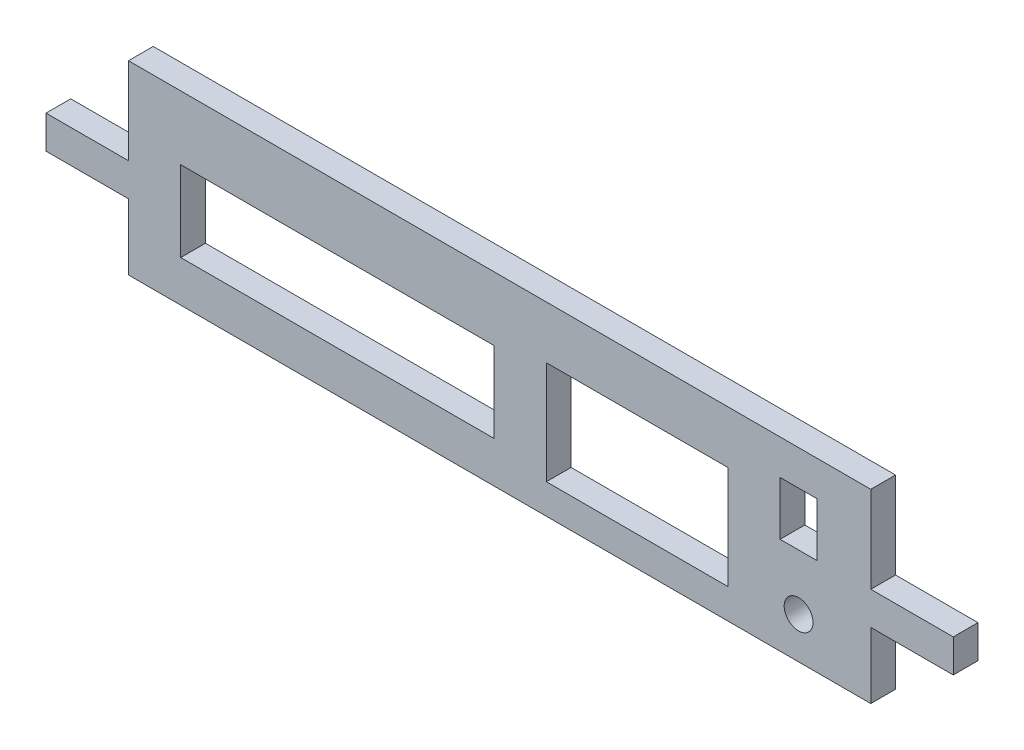
ISO-10303-21;
HEADER;
FILE_DESCRIPTION(('STEP AP214'),'2;1');
FILE_NAME('part.step','',(''),(''),'','','');
FILE_SCHEMA(('AUTOMOTIVE_DESIGN { 1 0 10303 214 1 1 1 1 }'));
ENDSEC;
DATA;
#1=APPLICATION_CONTEXT('core data for automotive mechanical design processes');
#2=APPLICATION_PROTOCOL_DEFINITION('international standard','automotive_design',2000,#1);
#3=PRODUCT_CONTEXT('',#1,'mechanical');
#4=PRODUCT('Part','Part','',(#3));
#5=PRODUCT_RELATED_PRODUCT_CATEGORY('part','',(#4));
#6=PRODUCT_DEFINITION_FORMATION('','',#4);
#7=PRODUCT_DEFINITION_CONTEXT('part definition',#1,'design');
#8=PRODUCT_DEFINITION('design','',#6,#7);
#9=PRODUCT_DEFINITION_SHAPE('','',#8);
#10=(LENGTH_UNIT() NAMED_UNIT(*) SI_UNIT(.MILLI.,.METRE.));
#11=(NAMED_UNIT(*) PLANE_ANGLE_UNIT() SI_UNIT($,.RADIAN.));
#12=(NAMED_UNIT(*) SI_UNIT($,.STERADIAN.) SOLID_ANGLE_UNIT());
#13=UNCERTAINTY_MEASURE_WITH_UNIT(LENGTH_MEASURE(1.E-05),#10,'distance_accuracy_value','');
#14=(GEOMETRIC_REPRESENTATION_CONTEXT(3) GLOBAL_UNCERTAINTY_ASSIGNED_CONTEXT((#13)) GLOBAL_UNIT_ASSIGNED_CONTEXT((#10,
#11,#12)) REPRESENTATION_CONTEXT('',''));
#15=CARTESIAN_POINT('',(0.,0.,0.));
#16=DIRECTION('',(0.,0.,1.));
#17=DIRECTION('',(1.,0.,0.));
#18=AXIS2_PLACEMENT_3D('',#15,#16,#17);
#19=CARTESIAN_POINT('',(0.,14.,6.));
#20=DIRECTION('',(0.,1.,0.));
#21=DIRECTION('',(0.,0.,1.));
#22=AXIS2_PLACEMENT_3D('',#19,#20,#21);
#23=PLANE('',#22);
#24=DIRECTION('',(1.,0.,0.));
#25=VECTOR('',#24,1.);
#26=CARTESIAN_POINT('',(0.,14.,0.));
#27=LINE('',#26,#25);
#28=CARTESIAN_POINT('',(67.9999999999999,14.,0.));
#29=VERTEX_POINT('',#28);
#30=CARTESIAN_POINT('',(76.9999999999999,14.,0.));
#31=VERTEX_POINT('',#30);
#32=EDGE_CURVE('E290',#29,#31,#27,.T.);
#33=ORIENTED_EDGE('',*,*,#32,.T.);
#34=DIRECTION('',(0.,0.,-1.));
#35=VECTOR('',#34,1.);
#36=CARTESIAN_POINT('',(76.9999999999999,14.,6.));
#37=LINE('',#36,#35);
#38=CARTESIAN_POINT('',(76.9999999999999,14.,6.));
#39=VERTEX_POINT('',#38);
#40=EDGE_CURVE('E11',#39,#31,#37,.T.);
#41=ORIENTED_EDGE('',*,*,#40,.F.);
#42=DIRECTION('',(1.,0.,0.));
#43=VECTOR('',#42,1.);
#44=CARTESIAN_POINT('',(0.,14.,6.));
#45=LINE('',#44,#43);
#46=CARTESIAN_POINT('',(67.9999999999999,14.,6.));
#47=VERTEX_POINT('',#46);
#48=EDGE_CURVE('E210',#47,#39,#45,.T.);
#49=ORIENTED_EDGE('',*,*,#48,.F.);
#50=DIRECTION('',(0.,0.,-1.));
#51=VECTOR('',#50,1.);
#52=CARTESIAN_POINT('',(67.9999999999999,14.,6.));
#53=LINE('',#52,#51);
#54=EDGE_CURVE('E54',#47,#29,#53,.T.);
#55=ORIENTED_EDGE('',*,*,#54,.T.);
#56=EDGE_LOOP('',(#33,#41,#49,#55));
#57=FACE_BOUND('',#56,.T.);
#58=ADVANCED_FACE('F35',(#57),#23,.F.);
#59=CARTESIAN_POINT('',(76.9999999999999,0.,6.));
#60=DIRECTION('',(1.,0.,0.));
#61=DIRECTION('',(0.,0.,-1.));
#62=AXIS2_PLACEMENT_3D('',#59,#60,#61);
#63=PLANE('',#62);
#64=DIRECTION('',(0.,-1.,0.));
#65=VECTOR('',#64,1.);
#66=CARTESIAN_POINT('',(76.9999999999999,0.,0.));
#67=LINE('',#66,#65);
#68=CARTESIAN_POINT('',(76.9999999999999,0.999999999999973,0.));
#69=VERTEX_POINT('',#68);
#70=EDGE_CURVE('E216',#31,#69,#67,.T.);
#71=ORIENTED_EDGE('',*,*,#70,.T.);
#72=DIRECTION('',(0.,0.,-1.));
#73=VECTOR('',#72,1.);
#74=CARTESIAN_POINT('',(76.9999999999999,0.999999999999973,6.));
#75=LINE('',#74,#73);
#76=CARTESIAN_POINT('',(76.9999999999999,0.999999999999973,6.));
#77=VERTEX_POINT('',#76);
#78=EDGE_CURVE('E45',#77,#69,#75,.T.);
#79=ORIENTED_EDGE('',*,*,#78,.F.);
#80=DIRECTION('',(0.,-1.,0.));
#81=VECTOR('',#80,1.);
#82=CARTESIAN_POINT('',(76.9999999999999,0.,6.));
#83=LINE('',#82,#81);
#84=EDGE_CURVE('E204',#39,#77,#83,.T.);
#85=ORIENTED_EDGE('',*,*,#84,.F.);
#86=ORIENTED_EDGE('',*,*,#40,.T.);
#87=EDGE_LOOP('',(#71,#79,#85,#86));
#88=FACE_BOUND('',#87,.T.);
#89=ADVANCED_FACE('F215',(#88),#63,.F.);
#90=CARTESIAN_POINT('',(0.,0.999999999999973,6.));
#91=DIRECTION('',(0.,1.,0.));
#92=DIRECTION('',(0.,0.,1.));
#93=AXIS2_PLACEMENT_3D('',#90,#91,#92);
#94=PLANE('',#93);
#95=DIRECTION('',(1.,0.,0.));
#96=VECTOR('',#95,1.);
#97=CARTESIAN_POINT('',(0.,0.999999999999973,0.));
#98=LINE('',#97,#96);
#99=CARTESIAN_POINT('',(67.9999999999999,0.999999999999973,0.));
#100=VERTEX_POINT('',#99);
#101=EDGE_CURVE('E293',#100,#69,#98,.T.);
#102=ORIENTED_EDGE('',*,*,#101,.F.);
#103=DIRECTION('',(0.,0.,-1.));
#104=VECTOR('',#103,1.);
#105=CARTESIAN_POINT('',(67.9999999999999,0.999999999999973,6.));
#106=LINE('',#105,#104);
#107=CARTESIAN_POINT('',(67.9999999999999,0.999999999999973,6.));
#108=VERTEX_POINT('',#107);
#109=EDGE_CURVE('E128',#108,#100,#106,.T.);
#110=ORIENTED_EDGE('',*,*,#109,.F.);
#111=DIRECTION('',(1.,0.,0.));
#112=VECTOR('',#111,1.);
#113=CARTESIAN_POINT('',(0.,0.999999999999973,6.));
#114=LINE('',#113,#112);
#115=EDGE_CURVE('E209',#108,#77,#114,.T.);
#116=ORIENTED_EDGE('',*,*,#115,.T.);
#117=ORIENTED_EDGE('',*,*,#78,.T.);
#118=EDGE_LOOP('',(#102,#110,#116,#117));
#119=FACE_BOUND('',#118,.T.);
#120=ADVANCED_FACE('F220',(#119),#94,.T.);
#121=CARTESIAN_POINT('',(0.,9.74999999999996,6.));
#122=DIRECTION('',(0.,1.,0.));
#123=DIRECTION('',(0.,0.,1.));
#124=AXIS2_PLACEMENT_3D('',#121,#122,#123);
#125=PLANE('',#124);
#126=DIRECTION('',(1.,0.,0.));
#127=VECTOR('',#126,1.);
#128=CARTESIAN_POINT('',(0.,9.74999999999996,0.));
#129=LINE('',#128,#127);
#130=CARTESIAN_POINT('',(11.3333333333333,9.74999999999996,0.));
#131=VERTEX_POINT('',#130);
#132=CARTESIAN_POINT('',(55.3333333333333,9.74999999999996,0.));
#133=VERTEX_POINT('',#132);
#134=EDGE_CURVE('E278',#131,#133,#129,.T.);
#135=ORIENTED_EDGE('',*,*,#134,.T.);
#136=DIRECTION('',(0.,0.,-1.));
#137=VECTOR('',#136,1.);
#138=CARTESIAN_POINT('',(55.3333333333333,9.74999999999996,6.));
#139=LINE('',#138,#137);
#140=CARTESIAN_POINT('',(55.3333333333333,9.74999999999996,6.));
#141=VERTEX_POINT('',#140);
#142=EDGE_CURVE('E300',#141,#133,#139,.T.);
#143=ORIENTED_EDGE('',*,*,#142,.F.);
#144=DIRECTION('',(1.,0.,0.));
#145=VECTOR('',#144,1.);
#146=CARTESIAN_POINT('',(0.,9.74999999999996,6.));
#147=LINE('',#146,#145);
#148=CARTESIAN_POINT('',(11.3333333333333,9.74999999999996,6.));
#149=VERTEX_POINT('',#148);
#150=EDGE_CURVE('E403',#149,#141,#147,.T.);
#151=ORIENTED_EDGE('',*,*,#150,.F.);
#152=DIRECTION('',(0.,0.,-1.));
#153=VECTOR('',#152,1.);
#154=CARTESIAN_POINT('',(11.3333333333333,9.74999999999996,6.));
#155=LINE('',#154,#153);
#156=EDGE_CURVE('E302',#149,#131,#155,.T.);
#157=ORIENTED_EDGE('',*,*,#156,.T.);
#158=EDGE_LOOP('',(#135,#143,#151,#157));
#159=FACE_BOUND('',#158,.T.);
#160=ADVANCED_FACE('F429',(#159),#125,.F.);
#161=CARTESIAN_POINT('',(55.3333333333333,0.,6.));
#162=DIRECTION('',(1.,0.,0.));
#163=DIRECTION('',(0.,1.,0.));
#164=AXIS2_PLACEMENT_3D('',#161,#162,#163);
#165=PLANE('',#164);
#166=DIRECTION('',(0.,-1.,0.));
#167=VECTOR('',#166,1.);
#168=CARTESIAN_POINT('',(55.3333333333333,0.,0.));
#169=LINE('',#168,#167);
#170=CARTESIAN_POINT('',(55.3333333333333,-15.25,0.));
#171=VERTEX_POINT('',#170);
#172=EDGE_CURVE('E281',#133,#171,#169,.T.);
#173=ORIENTED_EDGE('',*,*,#172,.T.);
#174=DIRECTION('',(0.,0.,-1.));
#175=VECTOR('',#174,1.);
#176=CARTESIAN_POINT('',(55.3333333333333,-15.25,6.));
#177=LINE('',#176,#175);
#178=CARTESIAN_POINT('',(55.3333333333333,-15.25,6.));
#179=VERTEX_POINT('',#178);
#180=EDGE_CURVE('E307',#179,#171,#177,.T.);
#181=ORIENTED_EDGE('',*,*,#180,.F.);
#182=DIRECTION('',(0.,-1.,0.));
#183=VECTOR('',#182,1.);
#184=CARTESIAN_POINT('',(55.3333333333333,0.,6.));
#185=LINE('',#184,#183);
#186=EDGE_CURVE('E406',#141,#179,#185,.T.);
#187=ORIENTED_EDGE('',*,*,#186,.F.);
#188=ORIENTED_EDGE('',*,*,#142,.T.);
#189=EDGE_LOOP('',(#173,#181,#187,#188));
#190=FACE_BOUND('',#189,.T.);
#191=ADVANCED_FACE('F431',(#190),#165,.F.);
#192=CARTESIAN_POINT('',(0.,-15.25,6.));
#193=DIRECTION('',(0.,1.,0.));
#194=DIRECTION('',(0.,0.,1.));
#195=AXIS2_PLACEMENT_3D('',#192,#193,#194);
#196=PLANE('',#195);
#197=DIRECTION('',(1.,0.,0.));
#198=VECTOR('',#197,1.);
#199=CARTESIAN_POINT('',(0.,-15.25,0.));
#200=LINE('',#199,#198);
#201=CARTESIAN_POINT('',(11.3333333333333,-15.25,0.));
#202=VERTEX_POINT('',#201);
#203=EDGE_CURVE('E284',#202,#171,#200,.T.);
#204=ORIENTED_EDGE('',*,*,#203,.F.);
#205=DIRECTION('',(0.,0.,-1.));
#206=VECTOR('',#205,1.);
#207=CARTESIAN_POINT('',(11.3333333333333,-15.25,6.));
#208=LINE('',#207,#206);
#209=CARTESIAN_POINT('',(11.3333333333333,-15.25,6.));
#210=VERTEX_POINT('',#209);
#211=EDGE_CURVE('E304',#210,#202,#208,.T.);
#212=ORIENTED_EDGE('',*,*,#211,.F.);
#213=DIRECTION('',(1.,0.,0.));
#214=VECTOR('',#213,1.);
#215=CARTESIAN_POINT('',(0.,-15.25,6.));
#216=LINE('',#215,#214);
#217=EDGE_CURVE('E408',#210,#179,#216,.T.);
#218=ORIENTED_EDGE('',*,*,#217,.T.);
#219=ORIENTED_EDGE('',*,*,#180,.T.);
#220=EDGE_LOOP('',(#204,#212,#218,#219));
#221=FACE_BOUND('',#220,.T.);
#222=ADVANCED_FACE('F424',(#221),#196,.T.);
#223=CARTESIAN_POINT('',(0.,22.5,6.));
#224=DIRECTION('',(0.,1.,0.));
#225=DIRECTION('',(0.,0.,1.));
#226=AXIS2_PLACEMENT_3D('',#223,#224,#225);
#227=PLANE('',#226);
#228=DIRECTION('',(1.,0.,0.));
#229=VECTOR('',#228,1.);
#230=CARTESIAN_POINT('',(0.,22.5,0.));
#231=LINE('',#230,#229);
#232=CARTESIAN_POINT('',(-90.,22.5,0.));
#233=VERTEX_POINT('',#232);
#234=CARTESIAN_POINT('',(90.,22.5,0.));
#235=VERTEX_POINT('',#234);
#236=EDGE_CURVE('E242',#233,#235,#231,.T.);
#237=ORIENTED_EDGE('',*,*,#236,.F.);
#238=DIRECTION('',(0.,0.,-1.));
#239=VECTOR('',#238,1.);
#240=CARTESIAN_POINT('',(-90.,22.5,6.));
#241=LINE('',#240,#239);
#242=CARTESIAN_POINT('',(-90.,22.5,6.));
#243=VERTEX_POINT('',#242);
#244=EDGE_CURVE('E305',#243,#233,#241,.T.);
#245=ORIENTED_EDGE('',*,*,#244,.F.);
#246=DIRECTION('',(1.,0.,0.));
#247=VECTOR('',#246,1.);
#248=CARTESIAN_POINT('',(0.,22.5,6.));
#249=LINE('',#248,#247);
#250=CARTESIAN_POINT('',(90.,22.5,6.));
#251=VERTEX_POINT('',#250);
#252=EDGE_CURVE('E363',#243,#251,#249,.T.);
#253=ORIENTED_EDGE('',*,*,#252,.T.);
#254=DIRECTION('',(0.,0.,-1.));
#255=VECTOR('',#254,1.);
#256=CARTESIAN_POINT('',(90.,22.5,6.));
#257=LINE('',#256,#255);
#258=EDGE_CURVE('E311',#251,#235,#257,.T.);
#259=ORIENTED_EDGE('',*,*,#258,.T.);
#260=EDGE_LOOP('',(#237,#245,#253,#259));
#261=FACE_BOUND('',#260,.T.);
#262=ADVANCED_FACE('F438',(#261),#227,.T.);
#263=CARTESIAN_POINT('',(-90.,0.,6.));
#264=DIRECTION('',(1.,0.,0.));
#265=DIRECTION('',(0.,1.,0.));
#266=AXIS2_PLACEMENT_3D('',#263,#264,#265);
#267=PLANE('',#266);
#268=DIRECTION('',(0.,-1.,0.));
#269=VECTOR('',#268,1.);
#270=CARTESIAN_POINT('',(-90.,0.,0.));
#271=LINE('',#270,#269);
#272=CARTESIAN_POINT('',(-90.,1.49999999999997,0.));
#273=VERTEX_POINT('',#272);
#274=EDGE_CURVE('E245',#233,#273,#271,.T.);
#275=ORIENTED_EDGE('',*,*,#274,.T.);
#276=DIRECTION('',(0.,0.,-1.));
#277=VECTOR('',#276,1.);
#278=CARTESIAN_POINT('',(-90.,1.49999999999997,6.));
#279=LINE('',#278,#277);
#280=CARTESIAN_POINT('',(-90.,1.49999999999997,6.));
#281=VERTEX_POINT('',#280);
#282=EDGE_CURVE('E333',#281,#273,#279,.T.);
#283=ORIENTED_EDGE('',*,*,#282,.F.);
#284=DIRECTION('',(0.,-1.,0.));
#285=VECTOR('',#284,1.);
#286=CARTESIAN_POINT('',(-90.,0.,6.));
#287=LINE('',#286,#285);
#288=EDGE_CURVE('E373',#243,#281,#287,.T.);
#289=ORIENTED_EDGE('',*,*,#288,.F.);
#290=ORIENTED_EDGE('',*,*,#244,.T.);
#291=EDGE_LOOP('',(#275,#283,#289,#290));
#292=FACE_BOUND('',#291,.T.);
#293=ADVANCED_FACE('F506',(#292),#267,.F.);
#294=CARTESIAN_POINT('',(0.,1.49999999999998,6.));
#295=DIRECTION('',(0.,-1.,0.));
#296=DIRECTION('',(1.,0.,0.));
#297=AXIS2_PLACEMENT_3D('',#294,#295,#296);
#298=PLANE('',#297);
#299=DIRECTION('',(-1.,0.,0.));
#300=VECTOR('',#299,1.);
#301=CARTESIAN_POINT('',(0.,1.49999999999998,0.));
#302=LINE('',#301,#300);
#303=CARTESIAN_POINT('',(-110.,1.49999999999996,0.));
#304=VERTEX_POINT('',#303);
#305=EDGE_CURVE('E248',#273,#304,#302,.T.);
#306=ORIENTED_EDGE('',*,*,#305,.T.);
#307=DIRECTION('',(0.,0.,-1.));
#308=VECTOR('',#307,1.);
#309=CARTESIAN_POINT('',(-110.,1.49999999999996,6.));
#310=LINE('',#309,#308);
#311=CARTESIAN_POINT('',(-110.,1.49999999999996,6.));
#312=VERTEX_POINT('',#311);
#313=EDGE_CURVE('E331',#312,#304,#310,.T.);
#314=ORIENTED_EDGE('',*,*,#313,.F.);
#315=DIRECTION('',(-1.,0.,0.));
#316=VECTOR('',#315,1.);
#317=CARTESIAN_POINT('',(0.,1.49999999999998,6.));
#318=LINE('',#317,#316);
#319=EDGE_CURVE('E376',#281,#312,#318,.T.);
#320=ORIENTED_EDGE('',*,*,#319,.F.);
#321=ORIENTED_EDGE('',*,*,#282,.T.);
#322=EDGE_LOOP('',(#306,#314,#320,#321));
#323=FACE_BOUND('',#322,.T.);
#324=ADVANCED_FACE('F502',(#323),#298,.F.);
#325=CARTESIAN_POINT('',(-110.,0.,6.));
#326=DIRECTION('',(-1.,0.,0.));
#327=DIRECTION('',(0.,0.,1.));
#328=AXIS2_PLACEMENT_3D('',#325,#326,#327);
#329=PLANE('',#328);
#330=DIRECTION('',(0.,1.,0.));
#331=VECTOR('',#330,1.);
#332=CARTESIAN_POINT('',(-110.,0.,0.));
#333=LINE('',#332,#331);
#334=CARTESIAN_POINT('',(-110.,-6.50000000000004,0.));
#335=VERTEX_POINT('',#334);
#336=EDGE_CURVE('E251',#335,#304,#333,.T.);
#337=ORIENTED_EDGE('',*,*,#336,.F.);
#338=DIRECTION('',(0.,0.,-1.));
#339=VECTOR('',#338,1.);
#340=CARTESIAN_POINT('',(-110.,-6.50000000000004,6.));
#341=LINE('',#340,#339);
#342=CARTESIAN_POINT('',(-110.,-6.50000000000004,6.));
#343=VERTEX_POINT('',#342);
#344=EDGE_CURVE('E329',#343,#335,#341,.T.);
#345=ORIENTED_EDGE('',*,*,#344,.F.);
#346=DIRECTION('',(0.,1.,0.));
#347=VECTOR('',#346,1.);
#348=CARTESIAN_POINT('',(-110.,0.,6.));
#349=LINE('',#348,#347);
#350=EDGE_CURVE('E378',#343,#312,#349,.T.);
#351=ORIENTED_EDGE('',*,*,#350,.T.);
#352=ORIENTED_EDGE('',*,*,#313,.T.);
#353=EDGE_LOOP('',(#337,#345,#351,#352));
#354=FACE_BOUND('',#353,.T.);
#355=ADVANCED_FACE('F498',(#354),#329,.T.);
#356=CARTESIAN_POINT('',(0.,-6.50000000000003,6.));
#357=DIRECTION('',(0.,-1.,0.));
#358=DIRECTION('',(1.,0.,0.));
#359=AXIS2_PLACEMENT_3D('',#356,#357,#358);
#360=PLANE('',#359);
#361=DIRECTION('',(-1.,0.,0.));
#362=VECTOR('',#361,1.);
#363=CARTESIAN_POINT('',(0.,-6.50000000000003,0.));
#364=LINE('',#363,#362);
#365=CARTESIAN_POINT('',(-90.,-6.50000000000003,0.));
#366=VERTEX_POINT('',#365);
#367=EDGE_CURVE('E254',#366,#335,#364,.T.);
#368=ORIENTED_EDGE('',*,*,#367,.F.);
#369=DIRECTION('',(0.,0.,-1.));
#370=VECTOR('',#369,1.);
#371=CARTESIAN_POINT('',(-90.,-6.50000000000003,6.));
#372=LINE('',#371,#370);
#373=CARTESIAN_POINT('',(-90.,-6.50000000000003,6.));
#374=VERTEX_POINT('',#373);
#375=EDGE_CURVE('E327',#374,#366,#372,.T.);
#376=ORIENTED_EDGE('',*,*,#375,.F.);
#377=DIRECTION('',(-1.,0.,0.));
#378=VECTOR('',#377,1.);
#379=CARTESIAN_POINT('',(0.,-6.50000000000003,6.));
#380=LINE('',#379,#378);
#381=EDGE_CURVE('E381',#374,#343,#380,.T.);
#382=ORIENTED_EDGE('',*,*,#381,.T.);
#383=ORIENTED_EDGE('',*,*,#344,.T.);
#384=EDGE_LOOP('',(#368,#376,#382,#383));
#385=FACE_BOUND('',#384,.T.);
#386=ADVANCED_FACE('F494',(#385),#360,.T.);
#387=CARTESIAN_POINT('',(-90.,1.56125112837913E-13,6.));
#388=DIRECTION('',(1.,0.,0.));
#389=DIRECTION('',(0.,1.,0.));
#390=AXIS2_PLACEMENT_3D('',#387,#388,#389);
#391=PLANE('',#390);
#392=DIRECTION('',(0.,-1.,0.));
#393=VECTOR('',#392,1.);
#394=CARTESIAN_POINT('',(-90.,1.56125112837913E-13,0.));
#395=LINE('',#394,#393);
#396=CARTESIAN_POINT('',(-90.,-22.5,0.));
#397=VERTEX_POINT('',#396);
#398=EDGE_CURVE('E257',#366,#397,#395,.T.);
#399=ORIENTED_EDGE('',*,*,#398,.T.);
#400=DIRECTION('',(0.,0.,-1.));
#401=VECTOR('',#400,1.);
#402=CARTESIAN_POINT('',(-90.,-22.5,6.));
#403=LINE('',#402,#401);
#404=CARTESIAN_POINT('',(-90.,-22.5,6.));
#405=VERTEX_POINT('',#404);
#406=EDGE_CURVE('E324',#405,#397,#403,.T.);
#407=ORIENTED_EDGE('',*,*,#406,.F.);
#408=DIRECTION('',(0.,-1.,0.));
#409=VECTOR('',#408,1.);
#410=CARTESIAN_POINT('',(-90.,1.56125112837913E-13,6.));
#411=LINE('',#410,#409);
#412=EDGE_CURVE('E384',#374,#405,#411,.T.);
#413=ORIENTED_EDGE('',*,*,#412,.F.);
#414=ORIENTED_EDGE('',*,*,#375,.T.);
#415=EDGE_LOOP('',(#399,#407,#413,#414));
#416=FACE_BOUND('',#415,.T.);
#417=ADVANCED_FACE('F490',(#416),#391,.F.);
#418=CARTESIAN_POINT('',(0.,-22.5,6.));
#419=DIRECTION('',(0.,1.,0.));
#420=DIRECTION('',(0.,0.,1.));
#421=AXIS2_PLACEMENT_3D('',#418,#419,#420);
#422=PLANE('',#421);
#423=DIRECTION('',(1.,0.,0.));
#424=VECTOR('',#423,1.);
#425=CARTESIAN_POINT('',(0.,-22.5,0.));
#426=LINE('',#425,#424);
#427=CARTESIAN_POINT('',(89.9999999999999,-22.5,0.));
#428=VERTEX_POINT('',#427);
#429=EDGE_CURVE('E260',#397,#428,#426,.T.);
#430=ORIENTED_EDGE('',*,*,#429,.T.);
#431=DIRECTION('',(0.,0.,-1.));
#432=VECTOR('',#431,1.);
#433=CARTESIAN_POINT('',(89.9999999999999,-22.5,6.));
#434=LINE('',#433,#432);
#435=CARTESIAN_POINT('',(89.9999999999999,-22.5,6.));
#436=VERTEX_POINT('',#435);
#437=EDGE_CURVE('E322',#436,#428,#434,.T.);
#438=ORIENTED_EDGE('',*,*,#437,.F.);
#439=DIRECTION('',(1.,0.,0.));
#440=VECTOR('',#439,1.);
#441=CARTESIAN_POINT('',(0.,-22.5,6.));
#442=LINE('',#441,#440);
#443=EDGE_CURVE('E387',#405,#436,#442,.T.);
#444=ORIENTED_EDGE('',*,*,#443,.F.);
#445=ORIENTED_EDGE('',*,*,#406,.T.);
#446=EDGE_LOOP('',(#430,#438,#444,#445));
#447=FACE_BOUND('',#446,.T.);
#448=ADVANCED_FACE('F486',(#447),#422,.F.);
#449=CARTESIAN_POINT('',(89.9999999999999,1.56125112837913E-13,6.));
#450=DIRECTION('',(1.,0.,0.));
#451=DIRECTION('',(0.,1.,0.));
#452=AXIS2_PLACEMENT_3D('',#449,#450,#451);
#453=PLANE('',#452);
#454=DIRECTION('',(0.,-1.,0.));
#455=VECTOR('',#454,1.);
#456=CARTESIAN_POINT('',(89.9999999999999,1.56125112837913E-13,0.));
#457=LINE('',#456,#455);
#458=CARTESIAN_POINT('',(89.9999999999999,-6.50000000000003,0.));
#459=VERTEX_POINT('',#458);
#460=EDGE_CURVE('E263',#459,#428,#457,.T.);
#461=ORIENTED_EDGE('',*,*,#460,.F.);
#462=DIRECTION('',(0.,0.,-1.));
#463=VECTOR('',#462,1.);
#464=CARTESIAN_POINT('',(89.9999999999999,-6.50000000000003,6.));
#465=LINE('',#464,#463);
#466=CARTESIAN_POINT('',(89.9999999999999,-6.50000000000003,6.));
#467=VERTEX_POINT('',#466);
#468=EDGE_CURVE('E320',#467,#459,#465,.T.);
#469=ORIENTED_EDGE('',*,*,#468,.F.);
#470=DIRECTION('',(0.,-1.,0.));
#471=VECTOR('',#470,1.);
#472=CARTESIAN_POINT('',(89.9999999999999,1.56125112837913E-13,6.));
#473=LINE('',#472,#471);
#474=EDGE_CURVE('E389',#467,#436,#473,.T.);
#475=ORIENTED_EDGE('',*,*,#474,.T.);
#476=ORIENTED_EDGE('',*,*,#437,.T.);
#477=EDGE_LOOP('',(#461,#469,#475,#476));
#478=FACE_BOUND('',#477,.T.);
#479=ADVANCED_FACE('F482',(#478),#453,.T.);
#480=CARTESIAN_POINT('',(0.,-6.50000000000003,6.));
#481=DIRECTION('',(0.,1.,0.));
#482=DIRECTION('',(-1.,0.,0.));
#483=AXIS2_PLACEMENT_3D('',#480,#481,#482);
#484=PLANE('',#483);
#485=DIRECTION('',(1.,0.,0.));
#486=VECTOR('',#485,1.);
#487=CARTESIAN_POINT('',(0.,-6.50000000000003,0.));
#488=LINE('',#487,#486);
#489=CARTESIAN_POINT('',(110.,-6.50000000000004,0.));
#490=VERTEX_POINT('',#489);
#491=EDGE_CURVE('E266',#459,#490,#488,.T.);
#492=ORIENTED_EDGE('',*,*,#491,.T.);
#493=DIRECTION('',(0.,0.,-1.));
#494=VECTOR('',#493,1.);
#495=CARTESIAN_POINT('',(110.,-6.50000000000004,6.));
#496=LINE('',#495,#494);
#497=CARTESIAN_POINT('',(110.,-6.50000000000004,6.));
#498=VERTEX_POINT('',#497);
#499=EDGE_CURVE('E317',#498,#490,#496,.T.);
#500=ORIENTED_EDGE('',*,*,#499,.F.);
#501=DIRECTION('',(1.,0.,0.));
#502=VECTOR('',#501,1.);
#503=CARTESIAN_POINT('',(0.,-6.50000000000003,6.));
#504=LINE('',#503,#502);
#505=EDGE_CURVE('E392',#467,#498,#504,.T.);
#506=ORIENTED_EDGE('',*,*,#505,.F.);
#507=ORIENTED_EDGE('',*,*,#468,.T.);
#508=EDGE_LOOP('',(#492,#500,#506,#507));
#509=FACE_BOUND('',#508,.T.);
#510=ADVANCED_FACE('F475',(#509),#484,.F.);
#511=CARTESIAN_POINT('',(110.,0.,6.));
#512=DIRECTION('',(-1.,0.,0.));
#513=DIRECTION('',(0.,0.,1.));
#514=AXIS2_PLACEMENT_3D('',#511,#512,#513);
#515=PLANE('',#514);
#516=DIRECTION('',(0.,1.,0.));
#517=VECTOR('',#516,1.);
#518=CARTESIAN_POINT('',(110.,0.,0.));
#519=LINE('',#518,#517);
#520=CARTESIAN_POINT('',(110.,1.49999999999996,0.));
#521=VERTEX_POINT('',#520);
#522=EDGE_CURVE('E269',#490,#521,#519,.T.);
#523=ORIENTED_EDGE('',*,*,#522,.T.);
#524=DIRECTION('',(0.,0.,-1.));
#525=VECTOR('',#524,1.);
#526=CARTESIAN_POINT('',(110.,1.49999999999996,6.));
#527=LINE('',#526,#525);
#528=CARTESIAN_POINT('',(110.,1.49999999999996,6.));
#529=VERTEX_POINT('',#528);
#530=EDGE_CURVE('E315',#529,#521,#527,.T.);
#531=ORIENTED_EDGE('',*,*,#530,.F.);
#532=DIRECTION('',(0.,1.,0.));
#533=VECTOR('',#532,1.);
#534=CARTESIAN_POINT('',(110.,0.,6.));
#535=LINE('',#534,#533);
#536=EDGE_CURVE('E395',#498,#529,#535,.T.);
#537=ORIENTED_EDGE('',*,*,#536,.F.);
#538=ORIENTED_EDGE('',*,*,#499,.T.);
#539=EDGE_LOOP('',(#523,#531,#537,#538));
#540=FACE_BOUND('',#539,.T.);
#541=ADVANCED_FACE('F469',(#540),#515,.F.);
#542=CARTESIAN_POINT('',(0.,1.49999999999998,6.));
#543=DIRECTION('',(0.,1.,0.));
#544=DIRECTION('',(-1.,0.,0.));
#545=AXIS2_PLACEMENT_3D('',#542,#543,#544);
#546=PLANE('',#545);
#547=DIRECTION('',(1.,0.,0.));
#548=VECTOR('',#547,1.);
#549=CARTESIAN_POINT('',(0.,1.49999999999998,0.));
#550=LINE('',#549,#548);
#551=CARTESIAN_POINT('',(89.9999999999999,1.49999999999997,0.));
#552=VERTEX_POINT('',#551);
#553=EDGE_CURVE('E272',#552,#521,#550,.T.);
#554=ORIENTED_EDGE('',*,*,#553,.F.);
#555=DIRECTION('',(0.,0.,-1.));
#556=VECTOR('',#555,1.);
#557=CARTESIAN_POINT('',(89.9999999999999,1.49999999999997,6.));
#558=LINE('',#557,#556);
#559=CARTESIAN_POINT('',(89.9999999999999,1.49999999999997,6.));
#560=VERTEX_POINT('',#559);
#561=EDGE_CURVE('E313',#560,#552,#558,.T.);
#562=ORIENTED_EDGE('',*,*,#561,.F.);
#563=DIRECTION('',(1.,0.,0.));
#564=VECTOR('',#563,1.);
#565=CARTESIAN_POINT('',(0.,1.49999999999998,6.));
#566=LINE('',#565,#564);
#567=EDGE_CURVE('E397',#560,#529,#566,.T.);
#568=ORIENTED_EDGE('',*,*,#567,.T.);
#569=ORIENTED_EDGE('',*,*,#530,.T.);
#570=EDGE_LOOP('',(#554,#562,#568,#569));
#571=FACE_BOUND('',#570,.T.);
#572=ADVANCED_FACE('F465',(#571),#546,.T.);
#573=CARTESIAN_POINT('',(-1.33333333333336,0.,6.));
#574=DIRECTION('',(-1.,0.,0.));
#575=DIRECTION('',(0.,-1.,0.));
#576=AXIS2_PLACEMENT_3D('',#573,#574,#575);
#577=PLANE('',#576);
#578=DIRECTION('',(0.,1.,0.));
#579=VECTOR('',#578,1.);
#580=CARTESIAN_POINT('',(-1.33333333333336,0.,0.));
#581=LINE('',#580,#579);
#582=CARTESIAN_POINT('',(-1.33333333333335,-12.5,0.));
#583=VERTEX_POINT('',#582);
#584=CARTESIAN_POINT('',(-1.33333333333336,6.99999999999997,0.));
#585=VERTEX_POINT('',#584);
#586=EDGE_CURVE('E230',#583,#585,#581,.T.);
#587=ORIENTED_EDGE('',*,*,#586,.F.);
#588=DIRECTION('',(0.,0.,-1.));
#589=VECTOR('',#588,1.);
#590=CARTESIAN_POINT('',(-1.33333333333335,-12.5,6.));
#591=LINE('',#590,#589);
#592=CARTESIAN_POINT('',(-1.33333333333335,-12.5,6.));
#593=VERTEX_POINT('',#592);
#594=EDGE_CURVE('E39',#593,#583,#591,.T.);
#595=ORIENTED_EDGE('',*,*,#594,.F.);
#596=DIRECTION('',(0.,1.,0.));
#597=VECTOR('',#596,1.);
#598=CARTESIAN_POINT('',(-1.33333333333336,0.,6.));
#599=LINE('',#598,#597);
#600=CARTESIAN_POINT('',(-1.33333333333336,6.99999999999997,6.));
#601=VERTEX_POINT('',#600);
#602=EDGE_CURVE('E367',#593,#601,#599,.T.);
#603=ORIENTED_EDGE('',*,*,#602,.T.);
#604=DIRECTION('',(0.,0.,-1.));
#605=VECTOR('',#604,1.);
#606=CARTESIAN_POINT('',(-1.33333333333336,6.99999999999997,6.));
#607=LINE('',#606,#605);
#608=EDGE_CURVE('E223',#601,#585,#607,.T.);
#609=ORIENTED_EDGE('',*,*,#608,.T.);
#610=EDGE_LOOP('',(#587,#595,#603,#609));
#611=FACE_BOUND('',#610,.T.);
#612=ADVANCED_FACE('F350',(#611),#577,.T.);
#613=CARTESIAN_POINT('',(0.,-12.5,6.));
#614=DIRECTION('',(0.,1.,0.));
#615=DIRECTION('',(0.,0.,1.));
#616=AXIS2_PLACEMENT_3D('',#613,#614,#615);
#617=PLANE('',#616);
#618=DIRECTION('',(1.,0.,0.));
#619=VECTOR('',#618,1.);
#620=CARTESIAN_POINT('',(0.,-12.5,0.));
#621=LINE('',#620,#619);
#622=CARTESIAN_POINT('',(-77.3333333333334,-12.5,0.));
#623=VERTEX_POINT('',#622);
#624=EDGE_CURVE('E233',#623,#583,#621,.T.);
#625=ORIENTED_EDGE('',*,*,#624,.F.);
#626=DIRECTION('',(0.,0.,-1.));
#627=VECTOR('',#626,1.);
#628=CARTESIAN_POINT('',(-77.3333333333334,-12.5,6.));
#629=LINE('',#628,#627);
#630=CARTESIAN_POINT('',(-77.3333333333334,-12.5,6.));
#631=VERTEX_POINT('',#630);
#632=EDGE_CURVE('E340',#631,#623,#629,.T.);
#633=ORIENTED_EDGE('',*,*,#632,.F.);
#634=DIRECTION('',(1.,0.,0.));
#635=VECTOR('',#634,1.);
#636=CARTESIAN_POINT('',(0.,-12.5,6.));
#637=LINE('',#636,#635);
#638=EDGE_CURVE('E349',#631,#593,#637,.T.);
#639=ORIENTED_EDGE('',*,*,#638,.T.);
#640=ORIENTED_EDGE('',*,*,#594,.T.);
#641=EDGE_LOOP('',(#625,#633,#639,#640));
#642=FACE_BOUND('',#641,.T.);
#643=ADVANCED_FACE('F347',(#642),#617,.T.);
#644=CARTESIAN_POINT('',(-77.3333333333333,0.,6.));
#645=DIRECTION('',(-1.,0.,0.));
#646=DIRECTION('',(0.,-1.,0.));
#647=AXIS2_PLACEMENT_3D('',#644,#645,#646);
#648=PLANE('',#647);
#649=DIRECTION('',(0.,1.,0.));
#650=VECTOR('',#649,1.);
#651=CARTESIAN_POINT('',(-77.3333333333333,0.,0.));
#652=LINE('',#651,#650);
#653=CARTESIAN_POINT('',(-77.3333333333333,6.99999999999997,0.));
#654=VERTEX_POINT('',#653);
#655=EDGE_CURVE('E236',#623,#654,#652,.T.);
#656=ORIENTED_EDGE('',*,*,#655,.T.);
#657=DIRECTION('',(0.,0.,-1.));
#658=VECTOR('',#657,1.);
#659=CARTESIAN_POINT('',(-77.3333333333333,6.99999999999997,6.));
#660=LINE('',#659,#658);
#661=CARTESIAN_POINT('',(-77.3333333333333,6.99999999999997,6.));
#662=VERTEX_POINT('',#661);
#663=EDGE_CURVE('E338',#662,#654,#660,.T.);
#664=ORIENTED_EDGE('',*,*,#663,.F.);
#665=DIRECTION('',(0.,1.,0.));
#666=VECTOR('',#665,1.);
#667=CARTESIAN_POINT('',(-77.3333333333333,0.,6.));
#668=LINE('',#667,#666);
#669=EDGE_CURVE('E358',#631,#662,#668,.T.);
#670=ORIENTED_EDGE('',*,*,#669,.F.);
#671=ORIENTED_EDGE('',*,*,#632,.T.);
#672=EDGE_LOOP('',(#656,#664,#670,#671));
#673=FACE_BOUND('',#672,.T.);
#674=ADVANCED_FACE('F356',(#673),#648,.F.);
#675=CARTESIAN_POINT('',(11.3333333333333,0.,6.));
#676=DIRECTION('',(1.,0.,0.));
#677=DIRECTION('',(0.,1.,0.));
#678=AXIS2_PLACEMENT_3D('',#675,#676,#677);
#679=PLANE('',#678);
#680=DIRECTION('',(0.,-1.,0.));
#681=VECTOR('',#680,1.);
#682=CARTESIAN_POINT('',(11.3333333333333,0.,0.));
#683=LINE('',#682,#681);
#684=EDGE_CURVE('E287',#131,#202,#683,.T.);
#685=ORIENTED_EDGE('',*,*,#684,.F.);
#686=ORIENTED_EDGE('',*,*,#156,.F.);
#687=DIRECTION('',(0.,-1.,0.));
#688=VECTOR('',#687,1.);
#689=CARTESIAN_POINT('',(11.3333333333333,0.,6.));
#690=LINE('',#689,#688);
#691=EDGE_CURVE('E411',#149,#210,#690,.T.);
#692=ORIENTED_EDGE('',*,*,#691,.T.);
#693=ORIENTED_EDGE('',*,*,#211,.T.);
#694=EDGE_LOOP('',(#685,#686,#692,#693));
#695=FACE_BOUND('',#694,.T.);
#696=ADVANCED_FACE('F416',(#695),#679,.T.);
#697=CARTESIAN_POINT('',(89.9999999999999,-2.37904933848247E-13,6.));
#698=DIRECTION('',(1.,0.,0.));
#699=DIRECTION('',(0.,1.,0.));
#700=AXIS2_PLACEMENT_3D('',#697,#698,#699);
#701=PLANE('',#700);
#702=DIRECTION('',(0.,-1.,0.));
#703=VECTOR('',#702,1.);
#704=CARTESIAN_POINT('',(89.9999999999999,-2.37904933848247E-13,0.));
#705=LINE('',#704,#703);
#706=EDGE_CURVE('E275',#235,#552,#705,.T.);
#707=ORIENTED_EDGE('',*,*,#706,.F.);
#708=ORIENTED_EDGE('',*,*,#258,.F.);
#709=DIRECTION('',(0.,-1.,0.));
#710=VECTOR('',#709,1.);
#711=CARTESIAN_POINT('',(89.9999999999999,-2.37904933848247E-13,6.));
#712=LINE('',#711,#710);
#713=EDGE_CURVE('E400',#251,#560,#712,.T.);
#714=ORIENTED_EDGE('',*,*,#713,.T.);
#715=ORIENTED_EDGE('',*,*,#561,.T.);
#716=EDGE_LOOP('',(#707,#708,#714,#715));
#717=FACE_BOUND('',#716,.T.);
#718=ADVANCED_FACE('F450',(#717),#701,.T.);
#719=CARTESIAN_POINT('',(0.,6.99999999999997,6.));
#720=DIRECTION('',(0.,1.,0.));
#721=DIRECTION('',(0.,0.,1.));
#722=AXIS2_PLACEMENT_3D('',#719,#720,#721);
#723=PLANE('',#722);
#724=DIRECTION('',(1.,0.,0.));
#725=VECTOR('',#724,1.);
#726=CARTESIAN_POINT('',(0.,6.99999999999997,0.));
#727=LINE('',#726,#725);
#728=EDGE_CURVE('E239',#654,#585,#727,.T.);
#729=ORIENTED_EDGE('',*,*,#728,.T.);
#730=ORIENTED_EDGE('',*,*,#608,.F.);
#731=DIRECTION('',(1.,0.,0.));
#732=VECTOR('',#731,1.);
#733=CARTESIAN_POINT('',(0.,6.99999999999997,6.));
#734=LINE('',#733,#732);
#735=EDGE_CURVE('E361',#662,#601,#734,.T.);
#736=ORIENTED_EDGE('',*,*,#735,.F.);
#737=ORIENTED_EDGE('',*,*,#663,.T.);
#738=EDGE_LOOP('',(#729,#730,#736,#737));
#739=FACE_BOUND('',#738,.T.);
#740=ADVANCED_FACE('F360',(#739),#723,.F.);
#741=CARTESIAN_POINT('',(72.4999999999999,-12.5,6.));
#742=DIRECTION('',(0.,0.,-1.));
#743=DIRECTION('',(-1.,0.,0.));
#744=AXIS2_PLACEMENT_3D('',#741,#742,#743);
#745=CYLINDRICAL_SURFACE('',#744,3.50000000000001);
#746=CARTESIAN_POINT('',(72.4999999999999,-12.5,6.));
#747=DIRECTION('',(0.,0.,1.));
#748=DIRECTION('',(1.,0.,0.));
#749=AXIS2_PLACEMENT_3D('',#746,#747,#748);
#750=CIRCLE('',#749,3.50000000000001);
#751=CARTESIAN_POINT('',(75.9999999999999,-12.5,6.));
#752=VERTEX_POINT('',#751);
#753=EDGE_CURVE('E298',#752,#752,#750,.T.);
#754=ORIENTED_EDGE('',*,*,#753,.T.);
#755=EDGE_LOOP('',(#754));
#756=FACE_BOUND('',#755,.T.);
#757=CARTESIAN_POINT('',(72.4999999999999,-12.5,0.));
#758=DIRECTION('',(0.,0.,1.));
#759=DIRECTION('',(1.,0.,0.));
#760=AXIS2_PLACEMENT_3D('',#757,#758,#759);
#761=CIRCLE('',#760,3.50000000000001);
#762=CARTESIAN_POINT('',(75.9999999999999,-12.5,0.));
#763=VERTEX_POINT('',#762);
#764=EDGE_CURVE('E227',#763,#763,#761,.T.);
#765=ORIENTED_EDGE('',*,*,#764,.F.);
#766=EDGE_LOOP('',(#765));
#767=FACE_BOUND('',#766,.T.);
#768=ADVANCED_FACE('F37',(#756,#767),#745,.F.);
#769=CARTESIAN_POINT('',(67.9999999999999,0.,6.));
#770=DIRECTION('',(1.,0.,0.));
#771=DIRECTION('',(0.,0.,-1.));
#772=AXIS2_PLACEMENT_3D('',#769,#770,#771);
#773=PLANE('',#772);
#774=DIRECTION('',(0.,-1.,0.));
#775=VECTOR('',#774,1.);
#776=CARTESIAN_POINT('',(67.9999999999999,0.,0.));
#777=LINE('',#776,#775);
#778=EDGE_CURVE('E295',#29,#100,#777,.T.);
#779=ORIENTED_EDGE('',*,*,#778,.F.);
#780=ORIENTED_EDGE('',*,*,#54,.F.);
#781=DIRECTION('',(0.,-1.,0.));
#782=VECTOR('',#781,1.);
#783=CARTESIAN_POINT('',(67.9999999999999,0.,6.));
#784=LINE('',#783,#782);
#785=EDGE_CURVE('E221',#47,#108,#784,.T.);
#786=ORIENTED_EDGE('',*,*,#785,.T.);
#787=ORIENTED_EDGE('',*,*,#109,.T.);
#788=EDGE_LOOP('',(#779,#780,#786,#787));
#789=FACE_BOUND('',#788,.T.);
#790=ADVANCED_FACE('F538',(#789),#773,.T.);
#791=CARTESIAN_POINT('',(0.,0.,6.));
#792=DIRECTION('',(0.,0.,1.));
#793=DIRECTION('',(1.,0.,0.));
#794=AXIS2_PLACEMENT_3D('',#791,#792,#793);
#795=PLANE('',#794);
#796=ORIENTED_EDGE('',*,*,#753,.F.);
#797=EDGE_LOOP('',(#796));
#798=FACE_BOUND('',#797,.T.);
#799=ORIENTED_EDGE('',*,*,#602,.F.);
#800=ORIENTED_EDGE('',*,*,#638,.F.);
#801=ORIENTED_EDGE('',*,*,#669,.T.);
#802=ORIENTED_EDGE('',*,*,#735,.T.);
#803=EDGE_LOOP('',(#799,#800,#801,#802));
#804=FACE_BOUND('',#803,.T.);
#805=ORIENTED_EDGE('',*,*,#252,.F.);
#806=ORIENTED_EDGE('',*,*,#288,.T.);
#807=ORIENTED_EDGE('',*,*,#319,.T.);
#808=ORIENTED_EDGE('',*,*,#350,.F.);
#809=ORIENTED_EDGE('',*,*,#381,.F.);
#810=ORIENTED_EDGE('',*,*,#412,.T.);
#811=ORIENTED_EDGE('',*,*,#443,.T.);
#812=ORIENTED_EDGE('',*,*,#474,.F.);
#813=ORIENTED_EDGE('',*,*,#505,.T.);
#814=ORIENTED_EDGE('',*,*,#536,.T.);
#815=ORIENTED_EDGE('',*,*,#567,.F.);
#816=ORIENTED_EDGE('',*,*,#713,.F.);
#817=EDGE_LOOP('',(#805,#806,#807,#808,#809,#810,#811,#812,#813,#814,#815,#816));
#818=FACE_BOUND('',#817,.T.);
#819=ORIENTED_EDGE('',*,*,#150,.T.);
#820=ORIENTED_EDGE('',*,*,#186,.T.);
#821=ORIENTED_EDGE('',*,*,#217,.F.);
#822=ORIENTED_EDGE('',*,*,#691,.F.);
#823=EDGE_LOOP('',(#819,#820,#821,#822));
#824=FACE_BOUND('',#823,.T.);
#825=ORIENTED_EDGE('',*,*,#48,.T.);
#826=ORIENTED_EDGE('',*,*,#84,.T.);
#827=ORIENTED_EDGE('',*,*,#115,.F.);
#828=ORIENTED_EDGE('',*,*,#785,.F.);
#829=EDGE_LOOP('',(#825,#826,#827,#828));
#830=FACE_BOUND('',#829,.T.);
#831=ADVANCED_FACE('F206',(#798,#804,#818,#824,#830),#795,.T.);
#832=CARTESIAN_POINT('',(0.,0.,0.));
#833=DIRECTION('',(0.,0.,1.));
#834=DIRECTION('',(1.,0.,0.));
#835=AXIS2_PLACEMENT_3D('',#832,#833,#834);
#836=PLANE('',#835);
#837=ORIENTED_EDGE('',*,*,#764,.T.);
#838=EDGE_LOOP('',(#837));
#839=FACE_BOUND('',#838,.T.);
#840=ORIENTED_EDGE('',*,*,#586,.T.);
#841=ORIENTED_EDGE('',*,*,#728,.F.);
#842=ORIENTED_EDGE('',*,*,#655,.F.);
#843=ORIENTED_EDGE('',*,*,#624,.T.);
#844=EDGE_LOOP('',(#840,#841,#842,#843));
#845=FACE_BOUND('',#844,.T.);
#846=ORIENTED_EDGE('',*,*,#236,.T.);
#847=ORIENTED_EDGE('',*,*,#706,.T.);
#848=ORIENTED_EDGE('',*,*,#553,.T.);
#849=ORIENTED_EDGE('',*,*,#522,.F.);
#850=ORIENTED_EDGE('',*,*,#491,.F.);
#851=ORIENTED_EDGE('',*,*,#460,.T.);
#852=ORIENTED_EDGE('',*,*,#429,.F.);
#853=ORIENTED_EDGE('',*,*,#398,.F.);
#854=ORIENTED_EDGE('',*,*,#367,.T.);
#855=ORIENTED_EDGE('',*,*,#336,.T.);
#856=ORIENTED_EDGE('',*,*,#305,.F.);
#857=ORIENTED_EDGE('',*,*,#274,.F.);
#858=EDGE_LOOP('',(#846,#847,#848,#849,#850,#851,#852,#853,#854,#855,#856,#857));
#859=FACE_BOUND('',#858,.T.);
#860=ORIENTED_EDGE('',*,*,#134,.F.);
#861=ORIENTED_EDGE('',*,*,#684,.T.);
#862=ORIENTED_EDGE('',*,*,#203,.T.);
#863=ORIENTED_EDGE('',*,*,#172,.F.);
#864=EDGE_LOOP('',(#860,#861,#862,#863));
#865=FACE_BOUND('',#864,.T.);
#866=ORIENTED_EDGE('',*,*,#32,.F.);
#867=ORIENTED_EDGE('',*,*,#778,.T.);
#868=ORIENTED_EDGE('',*,*,#101,.T.);
#869=ORIENTED_EDGE('',*,*,#70,.F.);
#870=EDGE_LOOP('',(#866,#867,#868,#869));
#871=FACE_BOUND('',#870,.T.);
#872=ADVANCED_FACE('F353',(#839,#845,#859,#865,#871),#836,.F.);
#873=CLOSED_SHELL('',(#58,#89,#120,#160,#191,#222,#262,#293,#324,#355,#386,#417,#448,#479,#510,
#541,#572,#612,#643,#674,#696,#718,#740,#768,#790,#831,#872));
#874=MANIFOLD_SOLID_BREP('B2',#873);
#875=ADVANCED_BREP_SHAPE_REPRESENTATION('',(#18,#874),#14);
#876=SHAPE_DEFINITION_REPRESENTATION(#9,#875);
ENDSEC;
END-ISO-10303-21;
